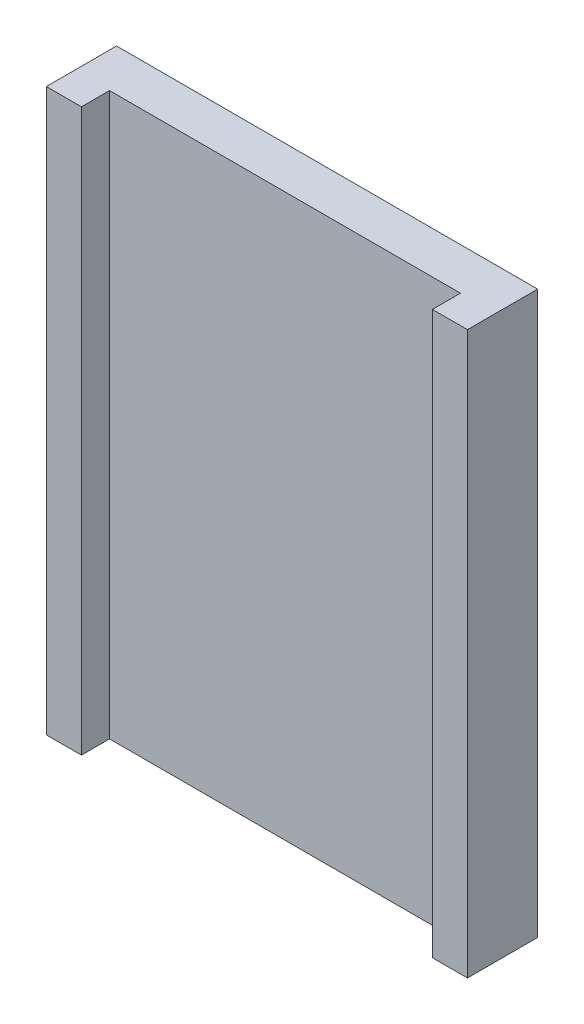
ISO-10303-21;
HEADER;
FILE_DESCRIPTION(('STEP AP214'),'2;1');
FILE_NAME('part.step','',(''),(''),'','','');
FILE_SCHEMA(('AUTOMOTIVE_DESIGN { 1 0 10303 214 1 1 1 1 }'));
ENDSEC;
DATA;
#1=APPLICATION_CONTEXT('core data for automotive mechanical design processes');
#2=APPLICATION_PROTOCOL_DEFINITION('international standard','automotive_design',2000,#1);
#3=PRODUCT_CONTEXT('',#1,'mechanical');
#4=PRODUCT('Part','Part','',(#3));
#5=PRODUCT_RELATED_PRODUCT_CATEGORY('part','',(#4));
#6=PRODUCT_DEFINITION_FORMATION('','',#4);
#7=PRODUCT_DEFINITION_CONTEXT('part definition',#1,'design');
#8=PRODUCT_DEFINITION('design','',#6,#7);
#9=PRODUCT_DEFINITION_SHAPE('','',#8);
#10=(LENGTH_UNIT() NAMED_UNIT(*) SI_UNIT(.MILLI.,.METRE.));
#11=(NAMED_UNIT(*) PLANE_ANGLE_UNIT() SI_UNIT($,.RADIAN.));
#12=(NAMED_UNIT(*) SI_UNIT($,.STERADIAN.) SOLID_ANGLE_UNIT());
#13=UNCERTAINTY_MEASURE_WITH_UNIT(LENGTH_MEASURE(1.E-05),#10,'distance_accuracy_value','');
#14=(GEOMETRIC_REPRESENTATION_CONTEXT(3) GLOBAL_UNCERTAINTY_ASSIGNED_CONTEXT((#13)) GLOBAL_UNIT_ASSIGNED_CONTEXT((#10,
#11,#12)) REPRESENTATION_CONTEXT('',''));
#15=CARTESIAN_POINT('',(0.,0.,0.));
#16=DIRECTION('',(0.,0.,1.));
#17=DIRECTION('',(1.,0.,0.));
#18=AXIS2_PLACEMENT_3D('',#15,#16,#17);
#19=CARTESIAN_POINT('',(0.,5.,0.75));
#20=DIRECTION('',(0.,1.,0.));
#21=DIRECTION('',(0.,0.,1.));
#22=AXIS2_PLACEMENT_3D('',#19,#20,#21);
#23=PLANE('',#22);
#24=DIRECTION('',(1.,0.,0.));
#25=VECTOR('',#24,1.);
#26=CARTESIAN_POINT('',(0.,5.,0.));
#27=LINE('',#26,#25);
#28=CARTESIAN_POINT('',(-3.75,5.,0.));
#29=VERTEX_POINT('',#28);
#30=CARTESIAN_POINT('',(3.75,5.,0.));
#31=VERTEX_POINT('',#30);
#32=EDGE_CURVE('E156',#29,#31,#27,.T.);
#33=ORIENTED_EDGE('',*,*,#32,.F.);
#34=DIRECTION('',(0.,0.,-1.));
#35=VECTOR('',#34,1.);
#36=CARTESIAN_POINT('',(-3.75,5.,1.25));
#37=LINE('',#36,#35);
#38=CARTESIAN_POINT('',(-3.75,5.,1.25));
#39=VERTEX_POINT('',#38);
#40=EDGE_CURVE('E108',#39,#29,#37,.T.);
#41=ORIENTED_EDGE('',*,*,#40,.F.);
#42=DIRECTION('',(1.,0.,0.));
#43=VECTOR('',#42,1.);
#44=CARTESIAN_POINT('',(0.,5.,1.25));
#45=LINE('',#44,#43);
#46=CARTESIAN_POINT('',(-3.125,5.,1.25));
#47=VERTEX_POINT('',#46);
#48=EDGE_CURVE('E113',#39,#47,#45,.T.);
#49=ORIENTED_EDGE('',*,*,#48,.T.);
#50=DIRECTION('',(0.,0.,-1.));
#51=VECTOR('',#50,1.);
#52=CARTESIAN_POINT('',(-3.125,5.,1.25));
#53=LINE('',#52,#51);
#54=CARTESIAN_POINT('',(-3.125,5.,0.75));
#55=VERTEX_POINT('',#54);
#56=EDGE_CURVE('E101',#47,#55,#53,.T.);
#57=ORIENTED_EDGE('',*,*,#56,.T.);
#58=DIRECTION('',(1.,0.,0.));
#59=VECTOR('',#58,1.);
#60=CARTESIAN_POINT('',(0.,5.,0.75));
#61=LINE('',#60,#59);
#62=CARTESIAN_POINT('',(3.125,5.,0.75));
#63=VERTEX_POINT('',#62);
#64=EDGE_CURVE('E158',#55,#63,#61,.T.);
#65=ORIENTED_EDGE('',*,*,#64,.T.);
#66=DIRECTION('',(0.,0.,-1.));
#67=VECTOR('',#66,1.);
#68=CARTESIAN_POINT('',(3.125,5.,1.25));
#69=LINE('',#68,#67);
#70=CARTESIAN_POINT('',(3.125,5.,1.25));
#71=VERTEX_POINT('',#70);
#72=EDGE_CURVE('E153',#71,#63,#69,.T.);
#73=ORIENTED_EDGE('',*,*,#72,.F.);
#74=DIRECTION('',(1.,0.,0.));
#75=VECTOR('',#74,1.);
#76=CARTESIAN_POINT('',(0.,5.,1.25));
#77=LINE('',#76,#75);
#78=CARTESIAN_POINT('',(3.75,5.,1.25));
#79=VERTEX_POINT('',#78);
#80=EDGE_CURVE('E132',#71,#79,#77,.T.);
#81=ORIENTED_EDGE('',*,*,#80,.T.);
#82=DIRECTION('',(0.,0.,-1.));
#83=VECTOR('',#82,1.);
#84=CARTESIAN_POINT('',(3.75,5.,1.25));
#85=LINE('',#84,#83);
#86=EDGE_CURVE('E142',#79,#31,#85,.T.);
#87=ORIENTED_EDGE('',*,*,#86,.T.);
#88=EDGE_LOOP('',(#33,#41,#49,#57,#65,#73,#81,#87));
#89=FACE_BOUND('',#88,.T.);
#90=ADVANCED_FACE('F36',(#89),#23,.T.);
#91=CARTESIAN_POINT('',(0.,-5.,0.75));
#92=DIRECTION('',(0.,1.,0.));
#93=DIRECTION('',(0.,0.,1.));
#94=AXIS2_PLACEMENT_3D('',#91,#92,#93);
#95=PLANE('',#94);
#96=DIRECTION('',(1.,0.,0.));
#97=VECTOR('',#96,1.);
#98=CARTESIAN_POINT('',(0.,-5.,0.));
#99=LINE('',#98,#97);
#100=CARTESIAN_POINT('',(-3.75,-5.,0.));
#101=VERTEX_POINT('',#100);
#102=CARTESIAN_POINT('',(3.75,-5.,0.));
#103=VERTEX_POINT('',#102);
#104=EDGE_CURVE('E39',#101,#103,#99,.T.);
#105=ORIENTED_EDGE('',*,*,#104,.T.);
#106=DIRECTION('',(0.,0.,-1.));
#107=VECTOR('',#106,1.);
#108=CARTESIAN_POINT('',(3.75,-5.,1.25));
#109=LINE('',#108,#107);
#110=CARTESIAN_POINT('',(3.75,-5.,1.25));
#111=VERTEX_POINT('',#110);
#112=EDGE_CURVE('E147',#111,#103,#109,.T.);
#113=ORIENTED_EDGE('',*,*,#112,.F.);
#114=DIRECTION('',(1.,0.,0.));
#115=VECTOR('',#114,1.);
#116=CARTESIAN_POINT('',(0.,-5.,1.25));
#117=LINE('',#116,#115);
#118=CARTESIAN_POINT('',(3.125,-5.,1.25));
#119=VERTEX_POINT('',#118);
#120=EDGE_CURVE('E137',#119,#111,#117,.T.);
#121=ORIENTED_EDGE('',*,*,#120,.F.);
#122=DIRECTION('',(0.,0.,-1.));
#123=VECTOR('',#122,1.);
#124=CARTESIAN_POINT('',(3.125,-5.,1.25));
#125=LINE('',#124,#123);
#126=CARTESIAN_POINT('',(3.125,-5.,0.75));
#127=VERTEX_POINT('',#126);
#128=EDGE_CURVE('E150',#119,#127,#125,.T.);
#129=ORIENTED_EDGE('',*,*,#128,.T.);
#130=DIRECTION('',(1.,0.,0.));
#131=VECTOR('',#130,1.);
#132=CARTESIAN_POINT('',(0.,-5.,0.75));
#133=LINE('',#132,#131);
#134=CARTESIAN_POINT('',(-3.125,-5.,0.75));
#135=VERTEX_POINT('',#134);
#136=EDGE_CURVE('E11',#135,#127,#133,.T.);
#137=ORIENTED_EDGE('',*,*,#136,.F.);
#138=DIRECTION('',(0.,0.,-1.));
#139=VECTOR('',#138,1.);
#140=CARTESIAN_POINT('',(-3.125,-5.,1.25));
#141=LINE('',#140,#139);
#142=CARTESIAN_POINT('',(-3.125,-5.,1.25));
#143=VERTEX_POINT('',#142);
#144=EDGE_CURVE('E52',#143,#135,#141,.T.);
#145=ORIENTED_EDGE('',*,*,#144,.F.);
#146=DIRECTION('',(1.,0.,0.));
#147=VECTOR('',#146,1.);
#148=CARTESIAN_POINT('',(0.,-5.,1.25));
#149=LINE('',#148,#147);
#150=CARTESIAN_POINT('',(-3.75,-5.,1.25));
#151=VERTEX_POINT('',#150);
#152=EDGE_CURVE('E115',#151,#143,#149,.T.);
#153=ORIENTED_EDGE('',*,*,#152,.F.);
#154=DIRECTION('',(0.,0.,-1.));
#155=VECTOR('',#154,1.);
#156=CARTESIAN_POINT('',(-3.75,-5.,1.25));
#157=LINE('',#156,#155);
#158=EDGE_CURVE('E128',#151,#101,#157,.T.);
#159=ORIENTED_EDGE('',*,*,#158,.T.);
#160=EDGE_LOOP('',(#105,#113,#121,#129,#137,#145,#153,#159));
#161=FACE_BOUND('',#160,.T.);
#162=ADVANCED_FACE('F164',(#161),#95,.F.);
#163=CARTESIAN_POINT('',(0.,0.,0.75));
#164=DIRECTION('',(0.,0.,1.));
#165=DIRECTION('',(1.,0.,0.));
#166=AXIS2_PLACEMENT_3D('',#163,#164,#165);
#167=PLANE('',#166);
#168=DIRECTION('',(0.,-1.,0.));
#169=VECTOR('',#168,1.);
#170=CARTESIAN_POINT('',(3.125,0.,0.75));
#171=LINE('',#170,#169);
#172=EDGE_CURVE('E59',#63,#127,#171,.T.);
#173=ORIENTED_EDGE('',*,*,#172,.F.);
#174=ORIENTED_EDGE('',*,*,#64,.F.);
#175=DIRECTION('',(0.,-1.,0.));
#176=VECTOR('',#175,1.);
#177=CARTESIAN_POINT('',(-3.125,0.,0.75));
#178=LINE('',#177,#176);
#179=EDGE_CURVE('E44',#55,#135,#178,.T.);
#180=ORIENTED_EDGE('',*,*,#179,.T.);
#181=ORIENTED_EDGE('',*,*,#136,.T.);
#182=EDGE_LOOP('',(#173,#174,#180,#181));
#183=FACE_BOUND('',#182,.T.);
#184=ADVANCED_FACE('F174',(#183),#167,.T.);
#185=CARTESIAN_POINT('',(0.,0.,0.));
#186=DIRECTION('',(0.,0.,1.));
#187=DIRECTION('',(1.,0.,0.));
#188=AXIS2_PLACEMENT_3D('',#185,#186,#187);
#189=PLANE('',#188);
#190=ORIENTED_EDGE('',*,*,#32,.T.);
#191=DIRECTION('',(0.,-1.,0.));
#192=VECTOR('',#191,1.);
#193=CARTESIAN_POINT('',(3.75,0.,0.));
#194=LINE('',#193,#192);
#195=EDGE_CURVE('E107',#31,#103,#194,.T.);
#196=ORIENTED_EDGE('',*,*,#195,.T.);
#197=ORIENTED_EDGE('',*,*,#104,.F.);
#198=DIRECTION('',(0.,-1.,0.));
#199=VECTOR('',#198,1.);
#200=CARTESIAN_POINT('',(-3.75,0.,0.));
#201=LINE('',#200,#199);
#202=EDGE_CURVE('E116',#29,#101,#201,.T.);
#203=ORIENTED_EDGE('',*,*,#202,.F.);
#204=EDGE_LOOP('',(#190,#196,#197,#203));
#205=FACE_BOUND('',#204,.T.);
#206=ADVANCED_FACE('F171',(#205),#189,.F.);
#207=CARTESIAN_POINT('',(3.125,0.,1.25));
#208=DIRECTION('',(1.,0.,0.));
#209=DIRECTION('',(0.,1.,0.));
#210=AXIS2_PLACEMENT_3D('',#207,#208,#209);
#211=PLANE('',#210);
#212=ORIENTED_EDGE('',*,*,#72,.T.);
#213=ORIENTED_EDGE('',*,*,#172,.T.);
#214=ORIENTED_EDGE('',*,*,#128,.F.);
#215=DIRECTION('',(0.,-1.,0.));
#216=VECTOR('',#215,1.);
#217=CARTESIAN_POINT('',(3.125,0.,1.25));
#218=LINE('',#217,#216);
#219=EDGE_CURVE('E135',#71,#119,#218,.T.);
#220=ORIENTED_EDGE('',*,*,#219,.F.);
#221=EDGE_LOOP('',(#212,#213,#214,#220));
#222=FACE_BOUND('',#221,.T.);
#223=ADVANCED_FACE('F173',(#222),#211,.F.);
#224=CARTESIAN_POINT('',(3.75,0.,1.25));
#225=DIRECTION('',(1.,0.,0.));
#226=DIRECTION('',(0.,1.,0.));
#227=AXIS2_PLACEMENT_3D('',#224,#225,#226);
#228=PLANE('',#227);
#229=ORIENTED_EDGE('',*,*,#195,.F.);
#230=ORIENTED_EDGE('',*,*,#86,.F.);
#231=DIRECTION('',(0.,-1.,0.));
#232=VECTOR('',#231,1.);
#233=CARTESIAN_POINT('',(3.75,0.,1.25));
#234=LINE('',#233,#232);
#235=EDGE_CURVE('E139',#79,#111,#234,.T.);
#236=ORIENTED_EDGE('',*,*,#235,.T.);
#237=ORIENTED_EDGE('',*,*,#112,.T.);
#238=EDGE_LOOP('',(#229,#230,#236,#237));
#239=FACE_BOUND('',#238,.T.);
#240=ADVANCED_FACE('F169',(#239),#228,.T.);
#241=CARTESIAN_POINT('',(0.,0.,1.25));
#242=DIRECTION('',(0.,0.,1.));
#243=DIRECTION('',(1.,0.,0.));
#244=AXIS2_PLACEMENT_3D('',#241,#242,#243);
#245=PLANE('',#244);
#246=ORIENTED_EDGE('',*,*,#80,.F.);
#247=ORIENTED_EDGE('',*,*,#219,.T.);
#248=ORIENTED_EDGE('',*,*,#120,.T.);
#249=ORIENTED_EDGE('',*,*,#235,.F.);
#250=EDGE_LOOP('',(#246,#247,#248,#249));
#251=FACE_BOUND('',#250,.T.);
#252=ADVANCED_FACE('F215',(#251),#245,.T.);
#253=CARTESIAN_POINT('',(-3.125,0.,1.25));
#254=DIRECTION('',(1.,0.,0.));
#255=DIRECTION('',(0.,1.,0.));
#256=AXIS2_PLACEMENT_3D('',#253,#254,#255);
#257=PLANE('',#256);
#258=ORIENTED_EDGE('',*,*,#179,.F.);
#259=ORIENTED_EDGE('',*,*,#56,.F.);
#260=DIRECTION('',(0.,-1.,0.));
#261=VECTOR('',#260,1.);
#262=CARTESIAN_POINT('',(-3.125,0.,1.25));
#263=LINE('',#262,#261);
#264=EDGE_CURVE('E104',#47,#143,#263,.T.);
#265=ORIENTED_EDGE('',*,*,#264,.T.);
#266=ORIENTED_EDGE('',*,*,#144,.T.);
#267=EDGE_LOOP('',(#258,#259,#265,#266));
#268=FACE_BOUND('',#267,.T.);
#269=ADVANCED_FACE('F103',(#268),#257,.T.);
#270=CARTESIAN_POINT('',(-3.75,0.,1.25));
#271=DIRECTION('',(1.,0.,0.));
#272=DIRECTION('',(0.,1.,0.));
#273=AXIS2_PLACEMENT_3D('',#270,#271,#272);
#274=PLANE('',#273);
#275=ORIENTED_EDGE('',*,*,#202,.T.);
#276=ORIENTED_EDGE('',*,*,#158,.F.);
#277=DIRECTION('',(0.,-1.,0.));
#278=VECTOR('',#277,1.);
#279=CARTESIAN_POINT('',(-3.75,0.,1.25));
#280=LINE('',#279,#278);
#281=EDGE_CURVE('E120',#39,#151,#280,.T.);
#282=ORIENTED_EDGE('',*,*,#281,.F.);
#283=ORIENTED_EDGE('',*,*,#40,.T.);
#284=EDGE_LOOP('',(#275,#276,#282,#283));
#285=FACE_BOUND('',#284,.T.);
#286=ADVANCED_FACE('F233',(#285),#274,.F.);
#287=CARTESIAN_POINT('',(0.,0.,1.25));
#288=DIRECTION('',(0.,0.,1.));
#289=DIRECTION('',(1.,0.,0.));
#290=AXIS2_PLACEMENT_3D('',#287,#288,#289);
#291=PLANE('',#290);
#292=ORIENTED_EDGE('',*,*,#264,.F.);
#293=ORIENTED_EDGE('',*,*,#48,.F.);
#294=ORIENTED_EDGE('',*,*,#281,.T.);
#295=ORIENTED_EDGE('',*,*,#152,.T.);
#296=EDGE_LOOP('',(#292,#293,#294,#295));
#297=FACE_BOUND('',#296,.T.);
#298=ADVANCED_FACE('F112',(#297),#291,.T.);
#299=CLOSED_SHELL('',(#90,#162,#184,#206,#223,#240,#252,#269,#286,#298));
#300=MANIFOLD_SOLID_BREP('B2',#299);
#301=ADVANCED_BREP_SHAPE_REPRESENTATION('',(#18,#300),#14);
#302=SHAPE_DEFINITION_REPRESENTATION(#9,#301);
ENDSEC;
END-ISO-10303-21;
